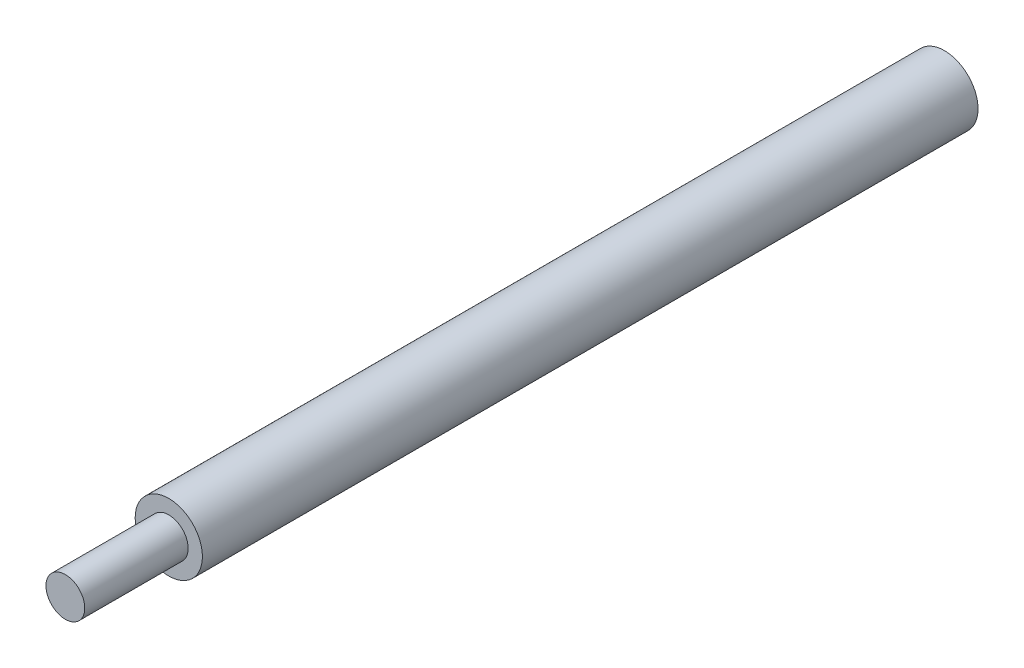
ISO-10303-21;
HEADER;
FILE_DESCRIPTION(('STEP AP214'),'2;1');
FILE_NAME('part.step','',(''),(''),'','','');
FILE_SCHEMA(('AUTOMOTIVE_DESIGN { 1 0 10303 214 1 1 1 1 }'));
ENDSEC;
DATA;
#1=APPLICATION_CONTEXT('core data for automotive mechanical design processes');
#2=APPLICATION_PROTOCOL_DEFINITION('international standard','automotive_design',2000,#1);
#3=PRODUCT_CONTEXT('',#1,'mechanical');
#4=PRODUCT('Part','Part','',(#3));
#5=PRODUCT_RELATED_PRODUCT_CATEGORY('part','',(#4));
#6=PRODUCT_DEFINITION_FORMATION('','',#4);
#7=PRODUCT_DEFINITION_CONTEXT('part definition',#1,'design');
#8=PRODUCT_DEFINITION('design','',#6,#7);
#9=PRODUCT_DEFINITION_SHAPE('','',#8);
#10=(LENGTH_UNIT() NAMED_UNIT(*) SI_UNIT(.MILLI.,.METRE.));
#11=(NAMED_UNIT(*) PLANE_ANGLE_UNIT() SI_UNIT($,.RADIAN.));
#12=(NAMED_UNIT(*) SI_UNIT($,.STERADIAN.) SOLID_ANGLE_UNIT());
#13=UNCERTAINTY_MEASURE_WITH_UNIT(LENGTH_MEASURE(1.E-05),#10,'distance_accuracy_value','');
#14=(GEOMETRIC_REPRESENTATION_CONTEXT(3) GLOBAL_UNCERTAINTY_ASSIGNED_CONTEXT((#13)) GLOBAL_UNIT_ASSIGNED_CONTEXT((#10,
#11,#12)) REPRESENTATION_CONTEXT('',''));
#15=CARTESIAN_POINT('',(0.,0.,0.));
#16=DIRECTION('',(0.,0.,1.));
#17=DIRECTION('',(1.,0.,0.));
#18=AXIS2_PLACEMENT_3D('',#15,#16,#17);
#19=CARTESIAN_POINT('',(0.,0.,8.));
#20=DIRECTION('',(0.,0.,-1.));
#21=DIRECTION('',(-1.,0.,0.));
#22=AXIS2_PLACEMENT_3D('',#19,#20,#21);
#23=CYLINDRICAL_SURFACE('',#22,1.5);
#24=CARTESIAN_POINT('',(0.,0.,8.));
#25=DIRECTION('',(0.,0.,1.));
#26=DIRECTION('',(1.,0.,0.));
#27=AXIS2_PLACEMENT_3D('',#24,#25,#26);
#28=CIRCLE('',#27,1.5);
#29=CARTESIAN_POINT('',(1.5,0.,8.));
#30=VERTEX_POINT('',#29);
#31=EDGE_CURVE('E10',#30,#30,#28,.T.);
#32=ORIENTED_EDGE('',*,*,#31,.F.);
#33=EDGE_LOOP('',(#32));
#34=FACE_BOUND('',#33,.T.);
#35=CARTESIAN_POINT('',(0.,0.,0.));
#36=DIRECTION('',(0.,0.,1.));
#37=DIRECTION('',(1.,0.,0.));
#38=AXIS2_PLACEMENT_3D('',#35,#36,#37);
#39=CIRCLE('',#38,1.5);
#40=CARTESIAN_POINT('',(1.5,0.,0.));
#41=VERTEX_POINT('',#40);
#42=EDGE_CURVE('E40',#41,#41,#39,.T.);
#43=ORIENTED_EDGE('',*,*,#42,.T.);
#44=EDGE_LOOP('',(#43));
#45=FACE_BOUND('',#44,.T.);
#46=ADVANCED_FACE('F37',(#34,#45),#23,.T.);
#47=CARTESIAN_POINT('',(0.,0.,8.));
#48=DIRECTION('',(0.,0.,1.));
#49=DIRECTION('',(1.,0.,0.));
#50=AXIS2_PLACEMENT_3D('',#47,#48,#49);
#51=PLANE('',#50);
#52=ORIENTED_EDGE('',*,*,#31,.T.);
#53=EDGE_LOOP('',(#52));
#54=FACE_BOUND('',#53,.T.);
#55=ADVANCED_FACE('F64',(#54),#51,.T.);
#56=CARTESIAN_POINT('',(0.,0.,-60.));
#57=DIRECTION('',(0.,0.,1.));
#58=DIRECTION('',(1.,0.,0.));
#59=AXIS2_PLACEMENT_3D('',#56,#57,#58);
#60=CYLINDRICAL_SURFACE('',#59,2.6);
#61=CARTESIAN_POINT('',(0.,0.,-60.));
#62=DIRECTION('',(0.,0.,-1.));
#63=DIRECTION('',(-1.,0.,0.));
#64=AXIS2_PLACEMENT_3D('',#61,#62,#63);
#65=CIRCLE('',#64,2.6);
#66=CARTESIAN_POINT('',(-2.6,0.,-60.));
#67=VERTEX_POINT('',#66);
#68=EDGE_CURVE('E49',#67,#67,#65,.T.);
#69=ORIENTED_EDGE('',*,*,#68,.F.);
#70=EDGE_LOOP('',(#69));
#71=FACE_BOUND('',#70,.T.);
#72=CARTESIAN_POINT('',(0.,0.,0.));
#73=DIRECTION('',(0.,0.,-1.));
#74=DIRECTION('',(-1.,0.,0.));
#75=AXIS2_PLACEMENT_3D('',#72,#73,#74);
#76=CIRCLE('',#75,2.6);
#77=CARTESIAN_POINT('',(-2.6,0.,0.));
#78=VERTEX_POINT('',#77);
#79=EDGE_CURVE('E51',#78,#78,#76,.T.);
#80=ORIENTED_EDGE('',*,*,#79,.T.);
#81=EDGE_LOOP('',(#80));
#82=FACE_BOUND('',#81,.T.);
#83=ADVANCED_FACE('F61',(#71,#82),#60,.T.);
#84=CARTESIAN_POINT('',(0.,0.,-60.));
#85=DIRECTION('',(0.,0.,-1.));
#86=DIRECTION('',(-1.,0.,0.));
#87=AXIS2_PLACEMENT_3D('',#84,#85,#86);
#88=PLANE('',#87);
#89=ORIENTED_EDGE('',*,*,#68,.T.);
#90=EDGE_LOOP('',(#89));
#91=FACE_BOUND('',#90,.T.);
#92=ADVANCED_FACE('F59',(#91),#88,.T.);
#93=CARTESIAN_POINT('',(0.,0.,0.));
#94=DIRECTION('',(0.,0.,-1.));
#95=DIRECTION('',(-1.,0.,0.));
#96=AXIS2_PLACEMENT_3D('',#93,#94,#95);
#97=PLANE('',#96);
#98=ORIENTED_EDGE('',*,*,#42,.F.);
#99=EDGE_LOOP('',(#98));
#100=FACE_BOUND('',#99,.T.);
#101=ORIENTED_EDGE('',*,*,#79,.F.);
#102=EDGE_LOOP('',(#101));
#103=FACE_BOUND('',#102,.T.);
#104=ADVANCED_FACE('F68',(#100,#103),#97,.F.);
#105=CLOSED_SHELL('',(#46,#55,#83,#92,#104));
#106=MANIFOLD_SOLID_BREP('B2',#105);
#107=ADVANCED_BREP_SHAPE_REPRESENTATION('',(#18,#106),#14);
#108=SHAPE_DEFINITION_REPRESENTATION(#9,#107);
ENDSEC;
END-ISO-10303-21;
